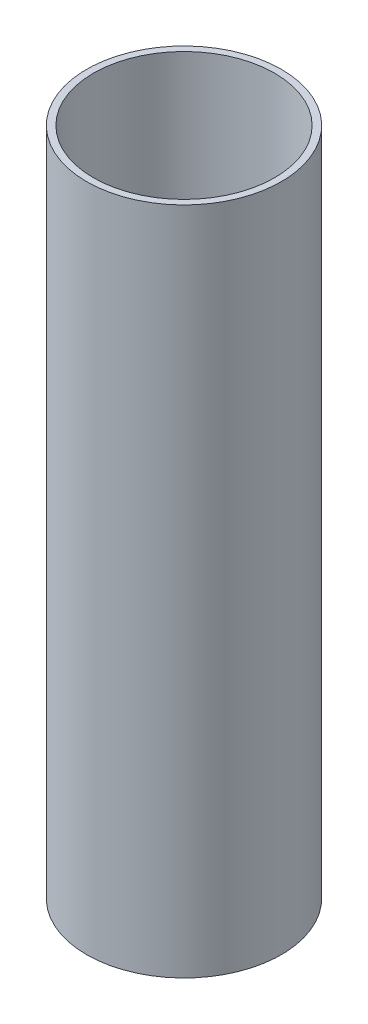
ISO-10303-21;
HEADER;
FILE_DESCRIPTION(('STEP AP214'),'2;1');
FILE_NAME('part.step','',(''),(''),'','','');
FILE_SCHEMA(('AUTOMOTIVE_DESIGN { 1 0 10303 214 1 1 1 1 }'));
ENDSEC;
DATA;
#1=APPLICATION_CONTEXT('core data for automotive mechanical design processes');
#2=APPLICATION_PROTOCOL_DEFINITION('international standard','automotive_design',2000,#1);
#3=PRODUCT_CONTEXT('',#1,'mechanical');
#4=PRODUCT('Part','Part','',(#3));
#5=PRODUCT_RELATED_PRODUCT_CATEGORY('part','',(#4));
#6=PRODUCT_DEFINITION_FORMATION('','',#4);
#7=PRODUCT_DEFINITION_CONTEXT('part definition',#1,'design');
#8=PRODUCT_DEFINITION('design','',#6,#7);
#9=PRODUCT_DEFINITION_SHAPE('','',#8);
#10=(LENGTH_UNIT() NAMED_UNIT(*) SI_UNIT(.MILLI.,.METRE.));
#11=(NAMED_UNIT(*) PLANE_ANGLE_UNIT() SI_UNIT($,.RADIAN.));
#12=(NAMED_UNIT(*) SI_UNIT($,.STERADIAN.) SOLID_ANGLE_UNIT());
#13=UNCERTAINTY_MEASURE_WITH_UNIT(LENGTH_MEASURE(1.E-05),#10,'distance_accuracy_value','');
#14=(GEOMETRIC_REPRESENTATION_CONTEXT(3) GLOBAL_UNCERTAINTY_ASSIGNED_CONTEXT((#13)) GLOBAL_UNIT_ASSIGNED_CONTEXT((#10,
#11,#12)) REPRESENTATION_CONTEXT('',''));
#15=CARTESIAN_POINT('',(0.,0.,0.));
#16=DIRECTION('',(0.,0.,1.));
#17=DIRECTION('',(1.,0.,0.));
#18=AXIS2_PLACEMENT_3D('',#15,#16,#17);
#19=CARTESIAN_POINT('',(0.,200.,0.));
#20=DIRECTION('',(0.,1.,0.));
#21=DIRECTION('',(0.,0.,1.));
#22=AXIS2_PLACEMENT_3D('',#19,#20,#21);
#23=PLANE('',#22);
#24=CARTESIAN_POINT('',(0.,200.,0.));
#25=DIRECTION('',(0.,1.,0.));
#26=DIRECTION('',(0.,0.,1.));
#27=AXIS2_PLACEMENT_3D('',#24,#25,#26);
#28=CIRCLE('',#27,29.083);
#29=CARTESIAN_POINT('',(0.,200.,29.083));
#30=VERTEX_POINT('',#29);
#31=EDGE_CURVE('E10',#30,#30,#28,.T.);
#32=ORIENTED_EDGE('',*,*,#31,.T.);
#33=EDGE_LOOP('',(#32));
#34=FACE_BOUND('',#33,.T.);
#35=CARTESIAN_POINT('',(0.,200.,0.));
#36=DIRECTION('',(0.,1.,0.));
#37=DIRECTION('',(0.,0.,1.));
#38=AXIS2_PLACEMENT_3D('',#35,#36,#37);
#39=CIRCLE('',#38,27.06751);
#40=CARTESIAN_POINT('',(0.,200.,27.06751));
#41=VERTEX_POINT('',#40);
#42=EDGE_CURVE('E48',#41,#41,#39,.T.);
#43=ORIENTED_EDGE('',*,*,#42,.F.);
#44=EDGE_LOOP('',(#43));
#45=FACE_BOUND('',#44,.T.);
#46=ADVANCED_FACE('F37',(#34,#45),#23,.T.);
#47=CARTESIAN_POINT('',(0.,0.,0.));
#48=DIRECTION('',(0.,1.,0.));
#49=DIRECTION('',(0.,0.,1.));
#50=AXIS2_PLACEMENT_3D('',#47,#48,#49);
#51=PLANE('',#50);
#52=CARTESIAN_POINT('',(0.,0.,0.));
#53=DIRECTION('',(0.,1.,0.));
#54=DIRECTION('',(0.,0.,1.));
#55=AXIS2_PLACEMENT_3D('',#52,#53,#54);
#56=CIRCLE('',#55,29.083);
#57=CARTESIAN_POINT('',(0.,0.,29.083));
#58=VERTEX_POINT('',#57);
#59=EDGE_CURVE('E41',#58,#58,#56,.T.);
#60=ORIENTED_EDGE('',*,*,#59,.F.);
#61=EDGE_LOOP('',(#60));
#62=FACE_BOUND('',#61,.T.);
#63=CARTESIAN_POINT('',(0.,0.,0.));
#64=DIRECTION('',(0.,1.,0.));
#65=DIRECTION('',(0.,0.,1.));
#66=AXIS2_PLACEMENT_3D('',#63,#64,#65);
#67=CIRCLE('',#66,27.06751);
#68=CARTESIAN_POINT('',(0.,0.,27.06751));
#69=VERTEX_POINT('',#68);
#70=EDGE_CURVE('E50',#69,#69,#67,.T.);
#71=ORIENTED_EDGE('',*,*,#70,.T.);
#72=EDGE_LOOP('',(#71));
#73=FACE_BOUND('',#72,.T.);
#74=ADVANCED_FACE('F60',(#62,#73),#51,.F.);
#75=CARTESIAN_POINT('',(0.,200.,0.));
#76=DIRECTION('',(0.,-1.,0.));
#77=DIRECTION('',(0.,0.,-1.));
#78=AXIS2_PLACEMENT_3D('',#75,#76,#77);
#79=CYLINDRICAL_SURFACE('',#78,29.083);
#80=ORIENTED_EDGE('',*,*,#31,.F.);
#81=EDGE_LOOP('',(#80));
#82=FACE_BOUND('',#81,.T.);
#83=ORIENTED_EDGE('',*,*,#59,.T.);
#84=EDGE_LOOP('',(#83));
#85=FACE_BOUND('',#84,.T.);
#86=ADVANCED_FACE('F39',(#82,#85),#79,.T.);
#87=CARTESIAN_POINT('',(0.,200.,0.));
#88=DIRECTION('',(0.,-1.,0.));
#89=DIRECTION('',(0.,0.,-1.));
#90=AXIS2_PLACEMENT_3D('',#87,#88,#89);
#91=CYLINDRICAL_SURFACE('',#90,27.06751);
#92=ORIENTED_EDGE('',*,*,#42,.T.);
#93=EDGE_LOOP('',(#92));
#94=FACE_BOUND('',#93,.T.);
#95=ORIENTED_EDGE('',*,*,#70,.F.);
#96=EDGE_LOOP('',(#95));
#97=FACE_BOUND('',#96,.T.);
#98=ADVANCED_FACE('F56',(#94,#97),#91,.F.);
#99=CLOSED_SHELL('',(#46,#74,#86,#98));
#100=MANIFOLD_SOLID_BREP('B2',#99);
#101=ADVANCED_BREP_SHAPE_REPRESENTATION('',(#18,#100),#14);
#102=SHAPE_DEFINITION_REPRESENTATION(#9,#101);
ENDSEC;
END-ISO-10303-21;
